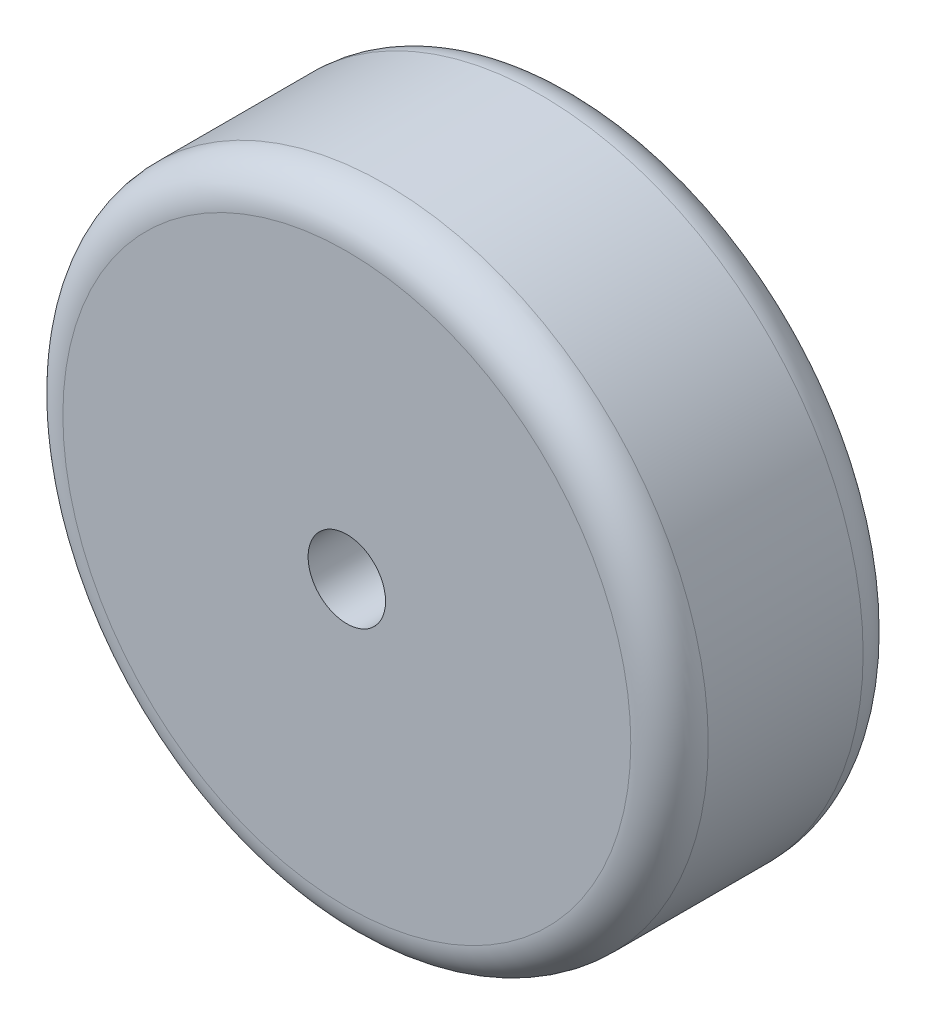
ISO-10303-21;
HEADER;
FILE_DESCRIPTION(('STEP AP214'),'2;1');
FILE_NAME('part.step','',(''),(''),'','','');
FILE_SCHEMA(('AUTOMOTIVE_DESIGN { 1 0 10303 214 1 1 1 1 }'));
ENDSEC;
DATA;
#1=APPLICATION_CONTEXT('core data for automotive mechanical design processes');
#2=APPLICATION_PROTOCOL_DEFINITION('international standard','automotive_design',2000,#1);
#3=PRODUCT_CONTEXT('',#1,'mechanical');
#4=PRODUCT('Part','Part','',(#3));
#5=PRODUCT_RELATED_PRODUCT_CATEGORY('part','',(#4));
#6=PRODUCT_DEFINITION_FORMATION('','',#4);
#7=PRODUCT_DEFINITION_CONTEXT('part definition',#1,'design');
#8=PRODUCT_DEFINITION('design','',#6,#7);
#9=PRODUCT_DEFINITION_SHAPE('','',#8);
#10=(LENGTH_UNIT() NAMED_UNIT(*) SI_UNIT(.MILLI.,.METRE.));
#11=(NAMED_UNIT(*) PLANE_ANGLE_UNIT() SI_UNIT($,.RADIAN.));
#12=(NAMED_UNIT(*) SI_UNIT($,.STERADIAN.) SOLID_ANGLE_UNIT());
#13=UNCERTAINTY_MEASURE_WITH_UNIT(LENGTH_MEASURE(1.E-05),#10,'distance_accuracy_value','');
#14=(GEOMETRIC_REPRESENTATION_CONTEXT(3) GLOBAL_UNCERTAINTY_ASSIGNED_CONTEXT((#13)) GLOBAL_UNIT_ASSIGNED_CONTEXT((#10,
#11,#12)) REPRESENTATION_CONTEXT('',''));
#15=CARTESIAN_POINT('',(0.,0.,0.));
#16=DIRECTION('',(0.,0.,1.));
#17=DIRECTION('',(1.,0.,0.));
#18=AXIS2_PLACEMENT_3D('',#15,#16,#17);
#19=CARTESIAN_POINT('',(0.,0.,18.));
#20=DIRECTION('',(0.,0.,1.));
#21=DIRECTION('',(1.,0.,0.));
#22=AXIS2_PLACEMENT_3D('',#19,#20,#21);
#23=PLANE('',#22);
#24=CARTESIAN_POINT('',(0.,0.,18.));
#25=DIRECTION('',(0.,0.,1.));
#26=DIRECTION('',(1.,0.,0.));
#27=AXIS2_PLACEMENT_3D('',#24,#25,#26);
#28=CIRCLE('',#27,22.);
#29=CARTESIAN_POINT('',(22.,0.,18.));
#30=VERTEX_POINT('',#29);
#31=EDGE_CURVE('E48',#30,#30,#28,.T.);
#32=ORIENTED_EDGE('',*,*,#31,.T.);
#33=EDGE_LOOP('',(#32));
#34=FACE_BOUND('',#33,.T.);
#35=CARTESIAN_POINT('',(0.,0.,18.));
#36=DIRECTION('',(0.,0.,1.));
#37=DIRECTION('',(1.,0.,0.));
#38=AXIS2_PLACEMENT_3D('',#35,#36,#37);
#39=CIRCLE('',#38,3.);
#40=CARTESIAN_POINT('',(3.,0.,18.));
#41=VERTEX_POINT('',#40);
#42=EDGE_CURVE('E53',#41,#41,#39,.T.);
#43=ORIENTED_EDGE('',*,*,#42,.F.);
#44=EDGE_LOOP('',(#43));
#45=FACE_BOUND('',#44,.T.);
#46=ADVANCED_FACE('F33',(#34,#45),#23,.T.);
#47=CARTESIAN_POINT('',(0.,0.,0.));
#48=DIRECTION('',(0.,0.,1.));
#49=DIRECTION('',(1.,0.,0.));
#50=AXIS2_PLACEMENT_3D('',#47,#48,#49);
#51=PLANE('',#50);
#52=CARTESIAN_POINT('',(0.,0.,0.));
#53=DIRECTION('',(0.,0.,1.));
#54=DIRECTION('',(1.,0.,0.));
#55=AXIS2_PLACEMENT_3D('',#52,#53,#54);
#56=CIRCLE('',#55,22.);
#57=CARTESIAN_POINT('',(22.,0.,0.));
#58=VERTEX_POINT('',#57);
#59=EDGE_CURVE('E10',#58,#58,#56,.F.);
#60=ORIENTED_EDGE('',*,*,#59,.T.);
#61=EDGE_LOOP('',(#60));
#62=FACE_BOUND('',#61,.T.);
#63=CARTESIAN_POINT('',(0.,0.,0.));
#64=DIRECTION('',(0.,0.,1.));
#65=DIRECTION('',(1.,0.,0.));
#66=AXIS2_PLACEMENT_3D('',#63,#64,#65);
#67=CIRCLE('',#66,3.);
#68=CARTESIAN_POINT('',(3.,0.,0.));
#69=VERTEX_POINT('',#68);
#70=EDGE_CURVE('E54',#69,#69,#67,.T.);
#71=ORIENTED_EDGE('',*,*,#70,.T.);
#72=EDGE_LOOP('',(#71));
#73=FACE_BOUND('',#72,.T.);
#74=ADVANCED_FACE('F64',(#62,#73),#51,.F.);
#75=CARTESIAN_POINT('',(0.,0.,18.));
#76=DIRECTION('',(0.,0.,-1.));
#77=DIRECTION('',(-1.,0.,0.));
#78=AXIS2_PLACEMENT_3D('',#75,#76,#77);
#79=CYLINDRICAL_SURFACE('',#78,25.);
#80=CARTESIAN_POINT('',(0.,0.,15.));
#81=DIRECTION('',(0.,0.,1.));
#82=DIRECTION('',(1.,0.,0.));
#83=AXIS2_PLACEMENT_3D('',#80,#81,#82);
#84=CIRCLE('',#83,25.);
#85=CARTESIAN_POINT('',(25.,0.,15.));
#86=VERTEX_POINT('',#85);
#87=EDGE_CURVE('E40',#86,#86,#84,.F.);
#88=ORIENTED_EDGE('',*,*,#87,.T.);
#89=EDGE_LOOP('',(#88));
#90=FACE_BOUND('',#89,.T.);
#91=CARTESIAN_POINT('',(0.,0.,3.));
#92=DIRECTION('',(0.,0.,1.));
#93=DIRECTION('',(1.,0.,0.));
#94=AXIS2_PLACEMENT_3D('',#91,#92,#93);
#95=CIRCLE('',#94,25.);
#96=CARTESIAN_POINT('',(25.,0.,3.));
#97=VERTEX_POINT('',#96);
#98=EDGE_CURVE('E44',#97,#97,#95,.T.);
#99=ORIENTED_EDGE('',*,*,#98,.T.);
#100=EDGE_LOOP('',(#99));
#101=FACE_BOUND('',#100,.T.);
#102=ADVANCED_FACE('F70',(#90,#101),#79,.T.);
#103=CARTESIAN_POINT('',(0.,0.,18.));
#104=DIRECTION('',(0.,0.,-1.));
#105=DIRECTION('',(-1.,0.,0.));
#106=AXIS2_PLACEMENT_3D('',#103,#104,#105);
#107=CYLINDRICAL_SURFACE('',#106,3.);
#108=ORIENTED_EDGE('',*,*,#42,.T.);
#109=EDGE_LOOP('',(#108));
#110=FACE_BOUND('',#109,.T.);
#111=ORIENTED_EDGE('',*,*,#70,.F.);
#112=EDGE_LOOP('',(#111));
#113=FACE_BOUND('',#112,.T.);
#114=ADVANCED_FACE('F60',(#110,#113),#107,.F.);
#115=CARTESIAN_POINT('',(0.,0.,15.));
#116=DIRECTION('',(0.,0.,1.));
#117=DIRECTION('',(1.,0.,0.));
#118=AXIS2_PLACEMENT_3D('',#115,#116,#117);
#119=TOROIDAL_SURFACE('',#118,22.,3.);
#120=ORIENTED_EDGE('',*,*,#87,.F.);
#121=EDGE_LOOP('',(#120));
#122=FACE_BOUND('',#121,.T.);
#123=ORIENTED_EDGE('',*,*,#31,.F.);
#124=EDGE_LOOP('',(#123));
#125=FACE_BOUND('',#124,.T.);
#126=ADVANCED_FACE('F75',(#122,#125),#119,.T.);
#127=CARTESIAN_POINT('',(0.,0.,3.));
#128=DIRECTION('',(0.,0.,1.));
#129=DIRECTION('',(1.,0.,0.));
#130=AXIS2_PLACEMENT_3D('',#127,#128,#129);
#131=TOROIDAL_SURFACE('',#130,22.,3.);
#132=ORIENTED_EDGE('',*,*,#59,.F.);
#133=EDGE_LOOP('',(#132));
#134=FACE_BOUND('',#133,.T.);
#135=ORIENTED_EDGE('',*,*,#98,.F.);
#136=EDGE_LOOP('',(#135));
#137=FACE_BOUND('',#136,.T.);
#138=ADVANCED_FACE('F35',(#134,#137),#131,.T.);
#139=CLOSED_SHELL('',(#46,#74,#102,#114,#126,#138));
#140=MANIFOLD_SOLID_BREP('B2',#139);
#141=ADVANCED_BREP_SHAPE_REPRESENTATION('',(#18,#140),#14);
#142=SHAPE_DEFINITION_REPRESENTATION(#9,#141);
ENDSEC;
END-ISO-10303-21;
